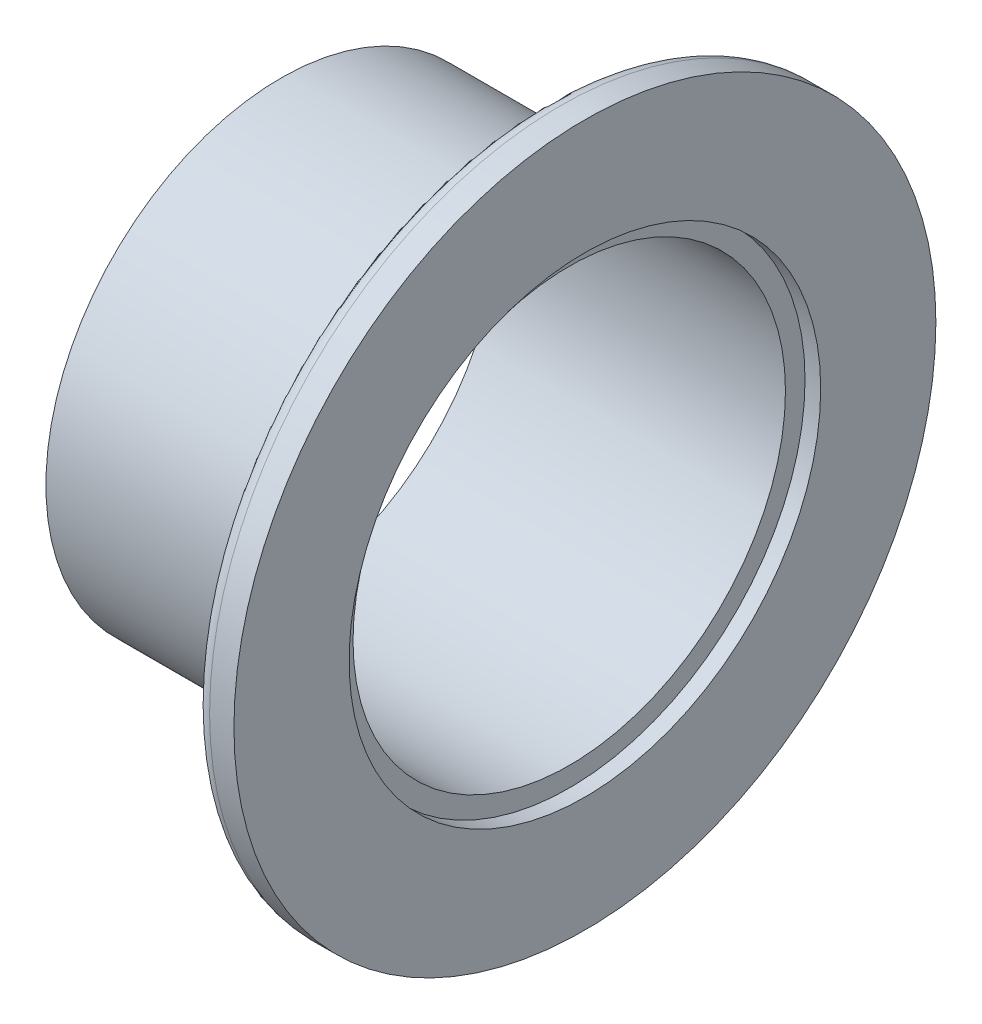
ISO-10303-21;
HEADER;
FILE_DESCRIPTION(('STEP AP214'),'2;1');
FILE_NAME('part.step','',(''),(''),'','','');
FILE_SCHEMA(('AUTOMOTIVE_DESIGN { 1 0 10303 214 1 1 1 1 }'));
ENDSEC;
DATA;
#1=APPLICATION_CONTEXT('core data for automotive mechanical design processes');
#2=APPLICATION_PROTOCOL_DEFINITION('international standard','automotive_design',2000,#1);
#3=PRODUCT_CONTEXT('',#1,'mechanical');
#4=PRODUCT('Part','Part','',(#3));
#5=PRODUCT_RELATED_PRODUCT_CATEGORY('part','',(#4));
#6=PRODUCT_DEFINITION_FORMATION('','',#4);
#7=PRODUCT_DEFINITION_CONTEXT('part definition',#1,'design');
#8=PRODUCT_DEFINITION('design','',#6,#7);
#9=PRODUCT_DEFINITION_SHAPE('','',#8);
#10=(LENGTH_UNIT() NAMED_UNIT(*) SI_UNIT(.MILLI.,.METRE.));
#11=(NAMED_UNIT(*) PLANE_ANGLE_UNIT() SI_UNIT($,.RADIAN.));
#12=(NAMED_UNIT(*) SI_UNIT($,.STERADIAN.) SOLID_ANGLE_UNIT());
#13=UNCERTAINTY_MEASURE_WITH_UNIT(LENGTH_MEASURE(1.E-05),#10,'distance_accuracy_value','');
#14=(GEOMETRIC_REPRESENTATION_CONTEXT(3) GLOBAL_UNCERTAINTY_ASSIGNED_CONTEXT((#13)) GLOBAL_UNIT_ASSIGNED_CONTEXT((#10,
#11,#12)) REPRESENTATION_CONTEXT('',''));
#15=CARTESIAN_POINT('',(0.,0.,0.));
#16=DIRECTION('',(0.,0.,1.));
#17=DIRECTION('',(1.,0.,0.));
#18=AXIS2_PLACEMENT_3D('',#15,#16,#17);
#19=CARTESIAN_POINT('',(19.05,0.,0.));
#20=DIRECTION('',(-1.,0.,0.));
#21=DIRECTION('',(0.,0.,1.));
#22=AXIS2_PLACEMENT_3D('',#19,#20,#21);
#23=CYLINDRICAL_SURFACE('',#22,17.526);
#24=CARTESIAN_POINT('',(0.,0.,0.));
#25=DIRECTION('',(1.,0.,0.));
#26=DIRECTION('',(0.,0.,-1.));
#27=AXIS2_PLACEMENT_3D('',#24,#25,#26);
#28=CIRCLE('',#27,17.526);
#29=CARTESIAN_POINT('',(0.,0.,-17.526));
#30=VERTEX_POINT('',#29);
#31=EDGE_CURVE('E54',#30,#30,#28,.T.);
#32=ORIENTED_EDGE('',*,*,#31,.F.);
#33=EDGE_LOOP('',(#32));
#34=FACE_BOUND('',#33,.T.);
#35=CARTESIAN_POINT('',(23.368,0.,0.));
#36=DIRECTION('',(1.,0.,0.));
#37=DIRECTION('',(0.,0.,-1.));
#38=AXIS2_PLACEMENT_3D('',#35,#36,#37);
#39=CIRCLE('',#38,17.526);
#40=CARTESIAN_POINT('',(23.368,0.,-17.526));
#41=VERTEX_POINT('',#40);
#42=EDGE_CURVE('E66',#41,#41,#39,.T.);
#43=ORIENTED_EDGE('',*,*,#42,.T.);
#44=EDGE_LOOP('',(#43));
#45=FACE_BOUND('',#44,.T.);
#46=ADVANCED_FACE('F33',(#34,#45),#23,.F.);
#47=CARTESIAN_POINT('',(0.,0.,0.));
#48=DIRECTION('',(1.,0.,0.));
#49=DIRECTION('',(0.,0.,-1.));
#50=AXIS2_PLACEMENT_3D('',#47,#48,#49);
#51=PLANE('',#50);
#52=CARTESIAN_POINT('',(0.,0.,0.));
#53=DIRECTION('',(1.,0.,0.));
#54=DIRECTION('',(0.,0.,-1.));
#55=AXIS2_PLACEMENT_3D('',#52,#53,#54);
#56=CIRCLE('',#55,19.05);
#57=CARTESIAN_POINT('',(0.,0.,-19.05));
#58=VERTEX_POINT('',#57);
#59=EDGE_CURVE('E51',#58,#58,#56,.T.);
#60=ORIENTED_EDGE('',*,*,#59,.F.);
#61=EDGE_LOOP('',(#60));
#62=FACE_BOUND('',#61,.T.);
#63=ORIENTED_EDGE('',*,*,#31,.T.);
#64=EDGE_LOOP('',(#63));
#65=FACE_BOUND('',#64,.T.);
#66=ADVANCED_FACE('F99',(#62,#65),#51,.F.);
#67=CARTESIAN_POINT('',(19.05,0.,0.));
#68=DIRECTION('',(-1.,0.,0.));
#69=DIRECTION('',(0.,0.,1.));
#70=AXIS2_PLACEMENT_3D('',#67,#68,#69);
#71=CYLINDRICAL_SURFACE('',#70,19.05);
#72=CARTESIAN_POINT('',(19.05,0.,0.));
#73=DIRECTION('',(1.,0.,0.));
#74=DIRECTION('',(0.,0.,-1.));
#75=AXIS2_PLACEMENT_3D('',#72,#73,#74);
#76=CIRCLE('',#75,19.05);
#77=CARTESIAN_POINT('',(19.05,0.,-19.05));
#78=VERTEX_POINT('',#77);
#79=EDGE_CURVE('E48',#78,#78,#76,.T.);
#80=ORIENTED_EDGE('',*,*,#79,.F.);
#81=EDGE_LOOP('',(#80));
#82=FACE_BOUND('',#81,.T.);
#83=ORIENTED_EDGE('',*,*,#59,.T.);
#84=EDGE_LOOP('',(#83));
#85=FACE_BOUND('',#84,.T.);
#86=ADVANCED_FACE('F94',(#82,#85),#71,.T.);
#87=CARTESIAN_POINT('',(24.638,0.,0.));
#88=DIRECTION('',(-1.,0.,0.));
#89=DIRECTION('',(0.,0.,1.));
#90=AXIS2_PLACEMENT_3D('',#87,#88,#89);
#91=CYLINDRICAL_SURFACE('',#90,28.448);
#92=CARTESIAN_POINT('',(22.666492538883,0.,0.));
#93=DIRECTION('',(-1.,0.,0.));
#94=DIRECTION('',(0.,0.,1.));
#95=AXIS2_PLACEMENT_3D('',#92,#93,#94);
#96=CIRCLE('',#95,28.448);
#97=CARTESIAN_POINT('',(22.666492538883,0.,28.448));
#98=VERTEX_POINT('',#97);
#99=EDGE_CURVE('E40',#98,#98,#96,.F.);
#100=ORIENTED_EDGE('',*,*,#99,.T.);
#101=EDGE_LOOP('',(#100));
#102=FACE_BOUND('',#101,.T.);
#103=CARTESIAN_POINT('',(24.638,0.,0.));
#104=DIRECTION('',(1.,0.,0.));
#105=DIRECTION('',(0.,0.,-1.));
#106=AXIS2_PLACEMENT_3D('',#103,#104,#105);
#107=CIRCLE('',#106,28.448);
#108=CARTESIAN_POINT('',(24.638,0.,-28.448));
#109=VERTEX_POINT('',#108);
#110=EDGE_CURVE('E59',#109,#109,#107,.T.);
#111=ORIENTED_EDGE('',*,*,#110,.F.);
#112=EDGE_LOOP('',(#111));
#113=FACE_BOUND('',#112,.T.);
#114=ADVANCED_FACE('F89',(#102,#113),#91,.T.);
#115=CARTESIAN_POINT('',(24.638,0.,0.));
#116=DIRECTION('',(1.,0.,0.));
#117=DIRECTION('',(0.,0.,-1.));
#118=AXIS2_PLACEMENT_3D('',#115,#116,#117);
#119=PLANE('',#118);
#120=CARTESIAN_POINT('',(24.638,0.,0.));
#121=DIRECTION('',(1.,0.,0.));
#122=DIRECTION('',(0.,0.,-1.));
#123=AXIS2_PLACEMENT_3D('',#120,#121,#122);
#124=CIRCLE('',#123,19.1135);
#125=CARTESIAN_POINT('',(24.638,0.,-19.1135));
#126=VERTEX_POINT('',#125);
#127=EDGE_CURVE('E63',#126,#126,#124,.T.);
#128=ORIENTED_EDGE('',*,*,#127,.F.);
#129=EDGE_LOOP('',(#128));
#130=FACE_BOUND('',#129,.T.);
#131=ORIENTED_EDGE('',*,*,#110,.T.);
#132=EDGE_LOOP('',(#131));
#133=FACE_BOUND('',#132,.T.);
#134=ADVANCED_FACE('F85',(#130,#133),#119,.T.);
#135=CARTESIAN_POINT('',(19.05,0.,0.));
#136=DIRECTION('',(1.,0.,0.));
#137=DIRECTION('',(0.,0.,-1.));
#138=AXIS2_PLACEMENT_3D('',#135,#136,#137);
#139=PLANE('',#138);
#140=CARTESIAN_POINT('',(19.05,0.,0.));
#141=DIRECTION('',(1.,0.,0.));
#142=DIRECTION('',(0.,0.,-1.));
#143=AXIS2_PLACEMENT_3D('',#140,#141,#142);
#144=CIRCLE('',#143,20.9549999999999);
#145=CARTESIAN_POINT('',(19.05,0.,-20.9549999999999));
#146=VERTEX_POINT('',#145);
#147=EDGE_CURVE('E44',#146,#146,#144,.F.);
#148=ORIENTED_EDGE('',*,*,#147,.T.);
#149=EDGE_LOOP('',(#148));
#150=FACE_BOUND('',#149,.T.);
#151=ORIENTED_EDGE('',*,*,#79,.T.);
#152=EDGE_LOOP('',(#151));
#153=FACE_BOUND('',#152,.T.);
#154=ADVANCED_FACE('F88',(#150,#153),#139,.F.);
#155=CARTESIAN_POINT('',(21.7772289653567,0.,0.));
#156=DIRECTION('',(1.,0.,0.));
#157=DIRECTION('',(0.,0.,-1.));
#158=AXIS2_PLACEMENT_3D('',#155,#156,#157);
#159=CONICAL_SURFACE('',#158,28.448,1.22173047639603);
#160=CARTESIAN_POINT('',(21.4730829104849,0.,0.));
#161=DIRECTION('',(1.,0.,0.));
#162=DIRECTION('',(0.,0.,-1.));
#163=AXIS2_PLACEMENT_3D('',#160,#161,#162);
#164=CIRCLE('',#163,27.6123655820236);
#165=CARTESIAN_POINT('',(21.4730829104849,0.,-27.6123655820236));
#166=VERTEX_POINT('',#165);
#167=EDGE_CURVE('E10',#166,#166,#164,.F.);
#168=ORIENTED_EDGE('',*,*,#167,.T.);
#169=EDGE_LOOP('',(#168));
#170=FACE_BOUND('',#169,.T.);
#171=ORIENTED_EDGE('',*,*,#147,.F.);
#172=EDGE_LOOP('',(#171));
#173=FACE_BOUND('',#172,.T.);
#174=ADVANCED_FACE('F113',(#170,#173),#159,.T.);
#175=CARTESIAN_POINT('',(22.666492538883,0.,0.));
#176=DIRECTION('',(-1.,0.,0.));
#177=DIRECTION('',(0.,0.,1.));
#178=AXIS2_PLACEMENT_3D('',#175,#176,#177);
#179=TOROIDAL_SURFACE('',#178,27.178,1.27);
#180=ORIENTED_EDGE('',*,*,#167,.F.);
#181=EDGE_LOOP('',(#180));
#182=FACE_BOUND('',#181,.T.);
#183=ORIENTED_EDGE('',*,*,#99,.F.);
#184=EDGE_LOOP('',(#183));
#185=FACE_BOUND('',#184,.T.);
#186=ADVANCED_FACE('F35',(#182,#185),#179,.T.);
#187=CARTESIAN_POINT('',(23.368,0.,0.));
#188=DIRECTION('',(1.,0.,0.));
#189=DIRECTION('',(0.,0.,-1.));
#190=AXIS2_PLACEMENT_3D('',#187,#188,#189);
#191=CYLINDRICAL_SURFACE('',#190,19.1135);
#192=CARTESIAN_POINT('',(23.368,0.,0.));
#193=DIRECTION('',(1.,0.,0.));
#194=DIRECTION('',(0.,0.,-1.));
#195=AXIS2_PLACEMENT_3D('',#192,#193,#194);
#196=CIRCLE('',#195,19.1135);
#197=CARTESIAN_POINT('',(23.368,0.,-19.1135));
#198=VERTEX_POINT('',#197);
#199=EDGE_CURVE('E62',#198,#198,#196,.T.);
#200=ORIENTED_EDGE('',*,*,#199,.F.);
#201=EDGE_LOOP('',(#200));
#202=FACE_BOUND('',#201,.T.);
#203=ORIENTED_EDGE('',*,*,#127,.T.);
#204=EDGE_LOOP('',(#203));
#205=FACE_BOUND('',#204,.T.);
#206=ADVANCED_FACE('F76',(#202,#205),#191,.F.);
#207=CARTESIAN_POINT('',(23.368,0.,0.));
#208=DIRECTION('',(1.,0.,0.));
#209=DIRECTION('',(0.,0.,-1.));
#210=AXIS2_PLACEMENT_3D('',#207,#208,#209);
#211=PLANE('',#210);
#212=ORIENTED_EDGE('',*,*,#42,.F.);
#213=EDGE_LOOP('',(#212));
#214=FACE_BOUND('',#213,.T.);
#215=ORIENTED_EDGE('',*,*,#199,.T.);
#216=EDGE_LOOP('',(#215));
#217=FACE_BOUND('',#216,.T.);
#218=ADVANCED_FACE('F73',(#214,#217),#211,.T.);
#219=CLOSED_SHELL('',(#46,#66,#86,#114,#134,#154,#174,#186,#206,#218));
#220=MANIFOLD_SOLID_BREP('B2',#219);
#221=ADVANCED_BREP_SHAPE_REPRESENTATION('',(#18,#220),#14);
#222=SHAPE_DEFINITION_REPRESENTATION(#9,#221);
ENDSEC;
END-ISO-10303-21;
